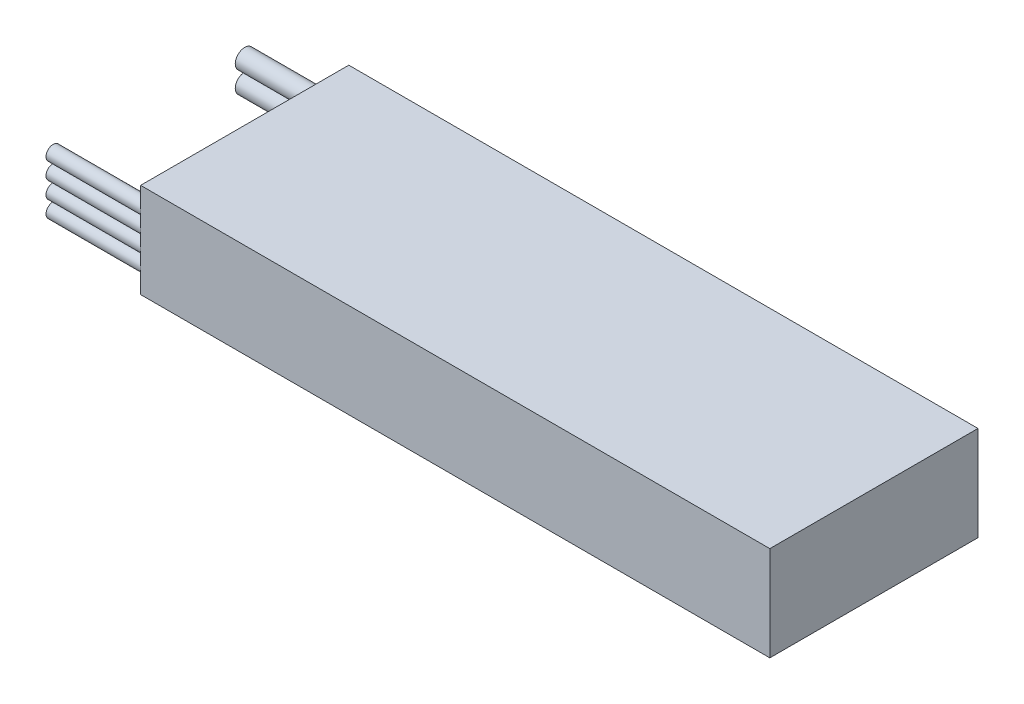
ISO-10303-21;
HEADER;
FILE_DESCRIPTION(('STEP AP214'),'2;1');
FILE_NAME('part.step','',(''),(''),'','','');
FILE_SCHEMA(('AUTOMOTIVE_DESIGN { 1 0 10303 214 1 1 1 1 }'));
ENDSEC;
DATA;
#1=APPLICATION_CONTEXT('core data for automotive mechanical design processes');
#2=APPLICATION_PROTOCOL_DEFINITION('international standard','automotive_design',2000,#1);
#3=PRODUCT_CONTEXT('',#1,'mechanical');
#4=PRODUCT('Part','Part','',(#3));
#5=PRODUCT_RELATED_PRODUCT_CATEGORY('part','',(#4));
#6=PRODUCT_DEFINITION_FORMATION('','',#4);
#7=PRODUCT_DEFINITION_CONTEXT('part definition',#1,'design');
#8=PRODUCT_DEFINITION('design','',#6,#7);
#9=PRODUCT_DEFINITION_SHAPE('','',#8);
#10=(LENGTH_UNIT() NAMED_UNIT(*) SI_UNIT(.MILLI.,.METRE.));
#11=(NAMED_UNIT(*) PLANE_ANGLE_UNIT() SI_UNIT($,.RADIAN.));
#12=(NAMED_UNIT(*) SI_UNIT($,.STERADIAN.) SOLID_ANGLE_UNIT());
#13=UNCERTAINTY_MEASURE_WITH_UNIT(LENGTH_MEASURE(1.E-05),#10,'distance_accuracy_value','');
#14=(GEOMETRIC_REPRESENTATION_CONTEXT(3) GLOBAL_UNCERTAINTY_ASSIGNED_CONTEXT((#13)) GLOBAL_UNIT_ASSIGNED_CONTEXT((#10,
#11,#12)) REPRESENTATION_CONTEXT('',''));
#15=CARTESIAN_POINT('',(0.,0.,0.));
#16=DIRECTION('',(0.,0.,1.));
#17=DIRECTION('',(1.,0.,0.));
#18=AXIS2_PLACEMENT_3D('',#15,#16,#17);
#19=CARTESIAN_POINT('',(66.5,20.,-22.));
#20=DIRECTION('',(-1.,0.,0.));
#21=DIRECTION('',(0.,0.,1.));
#22=AXIS2_PLACEMENT_3D('',#19,#20,#21);
#23=PLANE('',#22);
#24=DIRECTION('',(0.,0.,-1.));
#25=VECTOR('',#24,1.);
#26=CARTESIAN_POINT('',(66.5,0.,-22.));
#27=LINE('',#26,#25);
#28=CARTESIAN_POINT('',(66.5,0.,22.));
#29=VERTEX_POINT('',#28);
#30=CARTESIAN_POINT('',(66.5,0.,-22.));
#31=VERTEX_POINT('',#30);
#32=EDGE_CURVE('E157',#29,#31,#27,.T.);
#33=ORIENTED_EDGE('',*,*,#32,.T.);
#34=DIRECTION('',(0.,-1.,0.));
#35=VECTOR('',#34,1.);
#36=CARTESIAN_POINT('',(66.5,20.,-22.));
#37=LINE('',#36,#35);
#38=CARTESIAN_POINT('',(66.5,20.,-22.));
#39=VERTEX_POINT('',#38);
#40=EDGE_CURVE('E11',#39,#31,#37,.T.);
#41=ORIENTED_EDGE('',*,*,#40,.F.);
#42=DIRECTION('',(0.,0.,-1.));
#43=VECTOR('',#42,1.);
#44=CARTESIAN_POINT('',(66.5,20.,-22.));
#45=LINE('',#44,#43);
#46=CARTESIAN_POINT('',(66.5,20.,22.));
#47=VERTEX_POINT('',#46);
#48=EDGE_CURVE('E160',#47,#39,#45,.T.);
#49=ORIENTED_EDGE('',*,*,#48,.F.);
#50=DIRECTION('',(0.,-1.,0.));
#51=VECTOR('',#50,1.);
#52=CARTESIAN_POINT('',(66.5,20.,22.));
#53=LINE('',#52,#51);
#54=EDGE_CURVE('E113',#47,#29,#53,.T.);
#55=ORIENTED_EDGE('',*,*,#54,.T.);
#56=EDGE_LOOP('',(#33,#41,#49,#55));
#57=FACE_BOUND('',#56,.T.);
#58=ADVANCED_FACE('F37',(#57),#23,.F.);
#59=CARTESIAN_POINT('',(-66.5,20.,-22.));
#60=DIRECTION('',(0.,0.,1.));
#61=DIRECTION('',(1.,0.,0.));
#62=AXIS2_PLACEMENT_3D('',#59,#60,#61);
#63=PLANE('',#62);
#64=DIRECTION('',(-1.,0.,0.));
#65=VECTOR('',#64,1.);
#66=CARTESIAN_POINT('',(-66.5,0.,-22.));
#67=LINE('',#66,#65);
#68=CARTESIAN_POINT('',(-66.5,0.,-22.));
#69=VERTEX_POINT('',#68);
#70=EDGE_CURVE('E168',#31,#69,#67,.T.);
#71=ORIENTED_EDGE('',*,*,#70,.T.);
#72=DIRECTION('',(0.,-1.,0.));
#73=VECTOR('',#72,1.);
#74=CARTESIAN_POINT('',(-66.5,20.,-22.));
#75=LINE('',#74,#73);
#76=CARTESIAN_POINT('',(-66.5,7.75,-22.));
#77=VERTEX_POINT('',#76);
#78=EDGE_CURVE('E116',#77,#69,#75,.T.);
#79=ORIENTED_EDGE('',*,*,#78,.F.);
#80=CARTESIAN_POINT('',(-66.5,12.25,-22.));
#81=VERTEX_POINT('',#80);
#82=EDGE_CURVE('E120',#81,#77,#75,.T.);
#83=ORIENTED_EDGE('',*,*,#82,.F.);
#84=CARTESIAN_POINT('',(-66.5,20.,-22.));
#85=VERTEX_POINT('',#84);
#86=EDGE_CURVE('E45',#85,#81,#75,.T.);
#87=ORIENTED_EDGE('',*,*,#86,.F.);
#88=DIRECTION('',(-1.,0.,0.));
#89=VECTOR('',#88,1.);
#90=CARTESIAN_POINT('',(-66.5,20.,-22.));
#91=LINE('',#90,#89);
#92=EDGE_CURVE('E82',#39,#85,#91,.T.);
#93=ORIENTED_EDGE('',*,*,#92,.F.);
#94=ORIENTED_EDGE('',*,*,#40,.T.);
#95=EDGE_LOOP('',(#71,#79,#83,#87,#93,#94));
#96=FACE_BOUND('',#95,.T.);
#97=ADVANCED_FACE('F173',(#96),#63,.F.);
#98=CARTESIAN_POINT('',(-66.5,20.,-22.));
#99=DIRECTION('',(1.,0.,0.));
#100=DIRECTION('',(0.,0.,-1.));
#101=AXIS2_PLACEMENT_3D('',#98,#99,#100);
#102=PLANE('',#101);
#103=DIRECTION('',(0.,-1.,0.));
#104=VECTOR('',#103,1.);
#105=CARTESIAN_POINT('',(-66.5,20.,22.));
#106=LINE('',#105,#104);
#107=CARTESIAN_POINT('',(-66.5,4.75,22.));
#108=VERTEX_POINT('',#107);
#109=CARTESIAN_POINT('',(-66.5,0.,22.));
#110=VERTEX_POINT('',#109);
#111=EDGE_CURVE('E71',#108,#110,#106,.T.);
#112=ORIENTED_EDGE('',*,*,#111,.F.);
#113=CARTESIAN_POINT('',(-66.5,4.75,20.5));
#114=DIRECTION('',(-1.,0.,0.));
#115=DIRECTION('',(0.,0.,1.));
#116=AXIS2_PLACEMENT_3D('',#113,#114,#115);
#117=CIRCLE('',#116,1.5);
#118=EDGE_CURVE('E110',#108,#108,#117,.T.);
#119=ORIENTED_EDGE('',*,*,#118,.F.);
#120=CARTESIAN_POINT('',(-66.5,8.25,22.));
#121=VERTEX_POINT('',#120);
#122=EDGE_CURVE('E100',#121,#108,#106,.T.);
#123=ORIENTED_EDGE('',*,*,#122,.F.);
#124=CARTESIAN_POINT('',(-66.5,8.25,20.5));
#125=DIRECTION('',(-1.,0.,0.));
#126=DIRECTION('',(0.,0.,1.));
#127=AXIS2_PLACEMENT_3D('',#124,#125,#126);
#128=CIRCLE('',#127,1.5);
#129=EDGE_CURVE('E126',#121,#121,#128,.T.);
#130=ORIENTED_EDGE('',*,*,#129,.F.);
#131=CARTESIAN_POINT('',(-66.5,11.75,22.));
#132=VERTEX_POINT('',#131);
#133=EDGE_CURVE('E103',#132,#121,#106,.T.);
#134=ORIENTED_EDGE('',*,*,#133,.F.);
#135=CARTESIAN_POINT('',(-66.5,11.75,20.5));
#136=DIRECTION('',(-1.,0.,0.));
#137=DIRECTION('',(0.,0.,1.));
#138=AXIS2_PLACEMENT_3D('',#135,#136,#137);
#139=CIRCLE('',#138,1.5);
#140=EDGE_CURVE('E124',#132,#132,#139,.T.);
#141=ORIENTED_EDGE('',*,*,#140,.F.);
#142=CARTESIAN_POINT('',(-66.5,15.25,22.));
#143=VERTEX_POINT('',#142);
#144=EDGE_CURVE('E117',#143,#132,#106,.T.);
#145=ORIENTED_EDGE('',*,*,#144,.F.);
#146=CARTESIAN_POINT('',(-66.5,15.25,20.5));
#147=DIRECTION('',(-1.,0.,0.));
#148=DIRECTION('',(0.,0.,1.));
#149=AXIS2_PLACEMENT_3D('',#146,#147,#148);
#150=CIRCLE('',#149,1.5);
#151=EDGE_CURVE('E140',#143,#143,#150,.T.);
#152=ORIENTED_EDGE('',*,*,#151,.F.);
#153=CARTESIAN_POINT('',(-66.5,20.,22.));
#154=VERTEX_POINT('',#153);
#155=EDGE_CURVE('E114',#154,#143,#106,.T.);
#156=ORIENTED_EDGE('',*,*,#155,.F.);
#157=DIRECTION('',(0.,0.,1.));
#158=VECTOR('',#157,1.);
#159=CARTESIAN_POINT('',(-66.5,20.,-22.));
#160=LINE('',#159,#158);
#161=EDGE_CURVE('E163',#85,#154,#160,.T.);
#162=ORIENTED_EDGE('',*,*,#161,.F.);
#163=ORIENTED_EDGE('',*,*,#86,.T.);
#164=CARTESIAN_POINT('',(-66.5,12.25,-20.));
#165=DIRECTION('',(-1.,0.,0.));
#166=DIRECTION('',(0.,0.,1.));
#167=AXIS2_PLACEMENT_3D('',#164,#165,#166);
#168=CIRCLE('',#167,2.);
#169=EDGE_CURVE('E151',#81,#81,#168,.T.);
#170=ORIENTED_EDGE('',*,*,#169,.F.);
#171=ORIENTED_EDGE('',*,*,#82,.T.);
#172=CARTESIAN_POINT('',(-66.5,7.75,-20.));
#173=DIRECTION('',(-1.,0.,0.));
#174=DIRECTION('',(0.,0.,1.));
#175=AXIS2_PLACEMENT_3D('',#172,#173,#174);
#176=CIRCLE('',#175,2.);
#177=EDGE_CURVE('E145',#77,#77,#176,.T.);
#178=ORIENTED_EDGE('',*,*,#177,.F.);
#179=ORIENTED_EDGE('',*,*,#78,.T.);
#180=DIRECTION('',(0.,0.,1.));
#181=VECTOR('',#180,1.);
#182=CARTESIAN_POINT('',(-66.5,0.,-22.));
#183=LINE('',#182,#181);
#184=EDGE_CURVE('E112',#69,#110,#183,.T.);
#185=ORIENTED_EDGE('',*,*,#184,.T.);
#186=EDGE_LOOP('',(#112,#119,#123,#130,#134,#141,#145,#152,#156,#162,#163,#170,#171,#178,#179,#185));
#187=FACE_BOUND('',#186,.T.);
#188=ADVANCED_FACE('F108',(#187),#102,.F.);
#189=CARTESIAN_POINT('',(-66.5,20.,22.));
#190=DIRECTION('',(0.,0.,-1.));
#191=DIRECTION('',(-1.,0.,0.));
#192=AXIS2_PLACEMENT_3D('',#189,#190,#191);
#193=PLANE('',#192);
#194=DIRECTION('',(1.,0.,0.));
#195=VECTOR('',#194,1.);
#196=CARTESIAN_POINT('',(-66.5,0.,22.));
#197=LINE('',#196,#195);
#198=EDGE_CURVE('E75',#110,#29,#197,.T.);
#199=ORIENTED_EDGE('',*,*,#198,.T.);
#200=ORIENTED_EDGE('',*,*,#54,.F.);
#201=DIRECTION('',(1.,0.,0.));
#202=VECTOR('',#201,1.);
#203=CARTESIAN_POINT('',(-66.5,20.,22.));
#204=LINE('',#203,#202);
#205=EDGE_CURVE('E53',#154,#47,#204,.T.);
#206=ORIENTED_EDGE('',*,*,#205,.F.);
#207=ORIENTED_EDGE('',*,*,#155,.T.);
#208=ORIENTED_EDGE('',*,*,#144,.T.);
#209=ORIENTED_EDGE('',*,*,#133,.T.);
#210=ORIENTED_EDGE('',*,*,#122,.T.);
#211=ORIENTED_EDGE('',*,*,#111,.T.);
#212=EDGE_LOOP('',(#199,#200,#206,#207,#208,#209,#210,#211));
#213=FACE_BOUND('',#212,.T.);
#214=ADVANCED_FACE('F101',(#213),#193,.F.);
#215=CARTESIAN_POINT('',(0.,20.,0.));
#216=DIRECTION('',(0.,1.,0.));
#217=DIRECTION('',(0.,0.,1.));
#218=AXIS2_PLACEMENT_3D('',#215,#216,#217);
#219=PLANE('',#218);
#220=ORIENTED_EDGE('',*,*,#48,.T.);
#221=ORIENTED_EDGE('',*,*,#92,.T.);
#222=ORIENTED_EDGE('',*,*,#161,.T.);
#223=ORIENTED_EDGE('',*,*,#205,.T.);
#224=EDGE_LOOP('',(#220,#221,#222,#223));
#225=FACE_BOUND('',#224,.T.);
#226=ADVANCED_FACE('F182',(#225),#219,.T.);
#227=CARTESIAN_POINT('',(0.,0.,0.));
#228=DIRECTION('',(0.,1.,0.));
#229=DIRECTION('',(0.,0.,1.));
#230=AXIS2_PLACEMENT_3D('',#227,#228,#229);
#231=PLANE('',#230);
#232=ORIENTED_EDGE('',*,*,#32,.F.);
#233=ORIENTED_EDGE('',*,*,#198,.F.);
#234=ORIENTED_EDGE('',*,*,#184,.F.);
#235=ORIENTED_EDGE('',*,*,#70,.F.);
#236=EDGE_LOOP('',(#232,#233,#234,#235));
#237=FACE_BOUND('',#236,.T.);
#238=ADVANCED_FACE('F179',(#237),#231,.F.);
#239=CARTESIAN_POINT('',(-86.5,12.25,-20.));
#240=DIRECTION('',(1.,0.,0.));
#241=DIRECTION('',(0.,0.,-1.));
#242=AXIS2_PLACEMENT_3D('',#239,#240,#241);
#243=CYLINDRICAL_SURFACE('',#242,2.);
#244=CARTESIAN_POINT('',(-86.5,12.25,-20.));
#245=DIRECTION('',(-1.,0.,0.));
#246=DIRECTION('',(0.,0.,1.));
#247=AXIS2_PLACEMENT_3D('',#244,#245,#246);
#248=CIRCLE('',#247,2.);
#249=CARTESIAN_POINT('',(-86.5,12.25,-18.));
#250=VERTEX_POINT('',#249);
#251=EDGE_CURVE('E154',#250,#250,#248,.T.);
#252=ORIENTED_EDGE('',*,*,#251,.F.);
#253=EDGE_LOOP('',(#252));
#254=FACE_BOUND('',#253,.T.);
#255=ORIENTED_EDGE('',*,*,#169,.T.);
#256=EDGE_LOOP('',(#255));
#257=FACE_BOUND('',#256,.T.);
#258=ADVANCED_FACE('F216',(#254,#257),#243,.T.);
#259=CARTESIAN_POINT('',(-86.5,0.,0.));
#260=DIRECTION('',(-1.,0.,0.));
#261=DIRECTION('',(0.,0.,1.));
#262=AXIS2_PLACEMENT_3D('',#259,#260,#261);
#263=PLANE('',#262);
#264=ORIENTED_EDGE('',*,*,#251,.T.);
#265=EDGE_LOOP('',(#264));
#266=FACE_BOUND('',#265,.T.);
#267=ADVANCED_FACE('F221',(#266),#263,.T.);
#268=CARTESIAN_POINT('',(-86.5,7.75,-20.));
#269=DIRECTION('',(1.,0.,0.));
#270=DIRECTION('',(0.,0.,-1.));
#271=AXIS2_PLACEMENT_3D('',#268,#269,#270);
#272=CYLINDRICAL_SURFACE('',#271,2.);
#273=CARTESIAN_POINT('',(-86.5,7.75,-20.));
#274=DIRECTION('',(-1.,0.,0.));
#275=DIRECTION('',(0.,0.,1.));
#276=AXIS2_PLACEMENT_3D('',#273,#274,#275);
#277=CIRCLE('',#276,2.);
#278=CARTESIAN_POINT('',(-86.5,7.75,-18.));
#279=VERTEX_POINT('',#278);
#280=EDGE_CURVE('E148',#279,#279,#277,.T.);
#281=ORIENTED_EDGE('',*,*,#280,.F.);
#282=EDGE_LOOP('',(#281));
#283=FACE_BOUND('',#282,.T.);
#284=ORIENTED_EDGE('',*,*,#177,.T.);
#285=EDGE_LOOP('',(#284));
#286=FACE_BOUND('',#285,.T.);
#287=ADVANCED_FACE('F199',(#283,#286),#272,.T.);
#288=CARTESIAN_POINT('',(-86.5,0.,0.));
#289=DIRECTION('',(-1.,0.,0.));
#290=DIRECTION('',(0.,0.,1.));
#291=AXIS2_PLACEMENT_3D('',#288,#289,#290);
#292=PLANE('',#291);
#293=ORIENTED_EDGE('',*,*,#280,.T.);
#294=EDGE_LOOP('',(#293));
#295=FACE_BOUND('',#294,.T.);
#296=ADVANCED_FACE('F189',(#295),#292,.T.);
#297=CARTESIAN_POINT('',(-86.5,15.25,20.5));
#298=DIRECTION('',(1.,0.,0.));
#299=DIRECTION('',(0.,0.,-1.));
#300=AXIS2_PLACEMENT_3D('',#297,#298,#299);
#301=CYLINDRICAL_SURFACE('',#300,1.5);
#302=CARTESIAN_POINT('',(-86.5,15.25,20.5));
#303=DIRECTION('',(-1.,0.,0.));
#304=DIRECTION('',(0.,0.,1.));
#305=AXIS2_PLACEMENT_3D('',#302,#303,#304);
#306=CIRCLE('',#305,1.5);
#307=CARTESIAN_POINT('',(-86.5,15.25,22.));
#308=VERTEX_POINT('',#307);
#309=EDGE_CURVE('E142',#308,#308,#306,.T.);
#310=ORIENTED_EDGE('',*,*,#309,.F.);
#311=EDGE_LOOP('',(#310));
#312=FACE_BOUND('',#311,.T.);
#313=ORIENTED_EDGE('',*,*,#151,.T.);
#314=EDGE_LOOP('',(#313));
#315=FACE_BOUND('',#314,.T.);
#316=ADVANCED_FACE('F186',(#312,#315),#301,.T.);
#317=CARTESIAN_POINT('',(-86.5,0.,0.));
#318=DIRECTION('',(-1.,0.,0.));
#319=DIRECTION('',(0.,0.,1.));
#320=AXIS2_PLACEMENT_3D('',#317,#318,#319);
#321=PLANE('',#320);
#322=ORIENTED_EDGE('',*,*,#309,.T.);
#323=EDGE_LOOP('',(#322));
#324=FACE_BOUND('',#323,.T.);
#325=ADVANCED_FACE('F188',(#324),#321,.T.);
#326=CARTESIAN_POINT('',(-86.5,11.75,20.5));
#327=DIRECTION('',(1.,0.,0.));
#328=DIRECTION('',(0.,0.,-1.));
#329=AXIS2_PLACEMENT_3D('',#326,#327,#328);
#330=CYLINDRICAL_SURFACE('',#329,1.5);
#331=CARTESIAN_POINT('',(-86.5,11.75,20.5));
#332=DIRECTION('',(-1.,0.,0.));
#333=DIRECTION('',(0.,0.,1.));
#334=AXIS2_PLACEMENT_3D('',#331,#332,#333);
#335=CIRCLE('',#334,1.5);
#336=CARTESIAN_POINT('',(-86.5,11.75,22.));
#337=VERTEX_POINT('',#336);
#338=EDGE_CURVE('E137',#337,#337,#335,.T.);
#339=ORIENTED_EDGE('',*,*,#338,.F.);
#340=EDGE_LOOP('',(#339));
#341=FACE_BOUND('',#340,.T.);
#342=ORIENTED_EDGE('',*,*,#140,.T.);
#343=EDGE_LOOP('',(#342));
#344=FACE_BOUND('',#343,.T.);
#345=ADVANCED_FACE('F196',(#341,#344),#330,.T.);
#346=CARTESIAN_POINT('',(-86.5,0.,0.));
#347=DIRECTION('',(-1.,0.,0.));
#348=DIRECTION('',(0.,0.,1.));
#349=AXIS2_PLACEMENT_3D('',#346,#347,#348);
#350=PLANE('',#349);
#351=ORIENTED_EDGE('',*,*,#338,.T.);
#352=EDGE_LOOP('',(#351));
#353=FACE_BOUND('',#352,.T.);
#354=ADVANCED_FACE('F351',(#353),#350,.T.);
#355=CARTESIAN_POINT('',(-86.5,8.25,20.5));
#356=DIRECTION('',(1.,0.,0.));
#357=DIRECTION('',(0.,0.,-1.));
#358=AXIS2_PLACEMENT_3D('',#355,#356,#357);
#359=CYLINDRICAL_SURFACE('',#358,1.5);
#360=CARTESIAN_POINT('',(-86.5,8.25,20.5));
#361=DIRECTION('',(-1.,0.,0.));
#362=DIRECTION('',(0.,0.,1.));
#363=AXIS2_PLACEMENT_3D('',#360,#361,#362);
#364=CIRCLE('',#363,1.5);
#365=CARTESIAN_POINT('',(-86.5,8.25,22.));
#366=VERTEX_POINT('',#365);
#367=EDGE_CURVE('E128',#366,#366,#364,.T.);
#368=ORIENTED_EDGE('',*,*,#367,.F.);
#369=EDGE_LOOP('',(#368));
#370=FACE_BOUND('',#369,.T.);
#371=ORIENTED_EDGE('',*,*,#129,.T.);
#372=EDGE_LOOP('',(#371));
#373=FACE_BOUND('',#372,.T.);
#374=ADVANCED_FACE('F360',(#370,#373),#359,.T.);
#375=CARTESIAN_POINT('',(-86.5,0.,0.));
#376=DIRECTION('',(-1.,0.,0.));
#377=DIRECTION('',(0.,0.,1.));
#378=AXIS2_PLACEMENT_3D('',#375,#376,#377);
#379=PLANE('',#378);
#380=ORIENTED_EDGE('',*,*,#367,.T.);
#381=EDGE_LOOP('',(#380));
#382=FACE_BOUND('',#381,.T.);
#383=ADVANCED_FACE('F260',(#382),#379,.T.);
#384=CARTESIAN_POINT('',(-86.5,4.75,20.5));
#385=DIRECTION('',(1.,0.,0.));
#386=DIRECTION('',(0.,0.,-1.));
#387=AXIS2_PLACEMENT_3D('',#384,#385,#386);
#388=CYLINDRICAL_SURFACE('',#387,1.5);
#389=CARTESIAN_POINT('',(-86.5,4.75,20.5));
#390=DIRECTION('',(-1.,0.,0.));
#391=DIRECTION('',(0.,0.,1.));
#392=AXIS2_PLACEMENT_3D('',#389,#390,#391);
#393=CIRCLE('',#392,1.5);
#394=CARTESIAN_POINT('',(-86.5,4.75,22.));
#395=VERTEX_POINT('',#394);
#396=EDGE_CURVE('E129',#395,#395,#393,.T.);
#397=ORIENTED_EDGE('',*,*,#396,.F.);
#398=EDGE_LOOP('',(#397));
#399=FACE_BOUND('',#398,.T.);
#400=ORIENTED_EDGE('',*,*,#118,.T.);
#401=EDGE_LOOP('',(#400));
#402=FACE_BOUND('',#401,.T.);
#403=ADVANCED_FACE('F251',(#399,#402),#388,.T.);
#404=CARTESIAN_POINT('',(-86.5,0.,0.));
#405=DIRECTION('',(-1.,0.,0.));
#406=DIRECTION('',(0.,0.,1.));
#407=AXIS2_PLACEMENT_3D('',#404,#405,#406);
#408=PLANE('',#407);
#409=ORIENTED_EDGE('',*,*,#396,.T.);
#410=EDGE_LOOP('',(#409));
#411=FACE_BOUND('',#410,.T.);
#412=ADVANCED_FACE('F246',(#411),#408,.T.);
#413=CLOSED_SHELL('',(#58,#97,#188,#214,#226,#238,#258,#267,#287,#296,#316,#325,#345,#354,#374,
#383,#403,#412));
#414=MANIFOLD_SOLID_BREP('B2',#413);
#415=ADVANCED_BREP_SHAPE_REPRESENTATION('',(#18,#414),#14);
#416=SHAPE_DEFINITION_REPRESENTATION(#9,#415);
ENDSEC;
END-ISO-10303-21;
